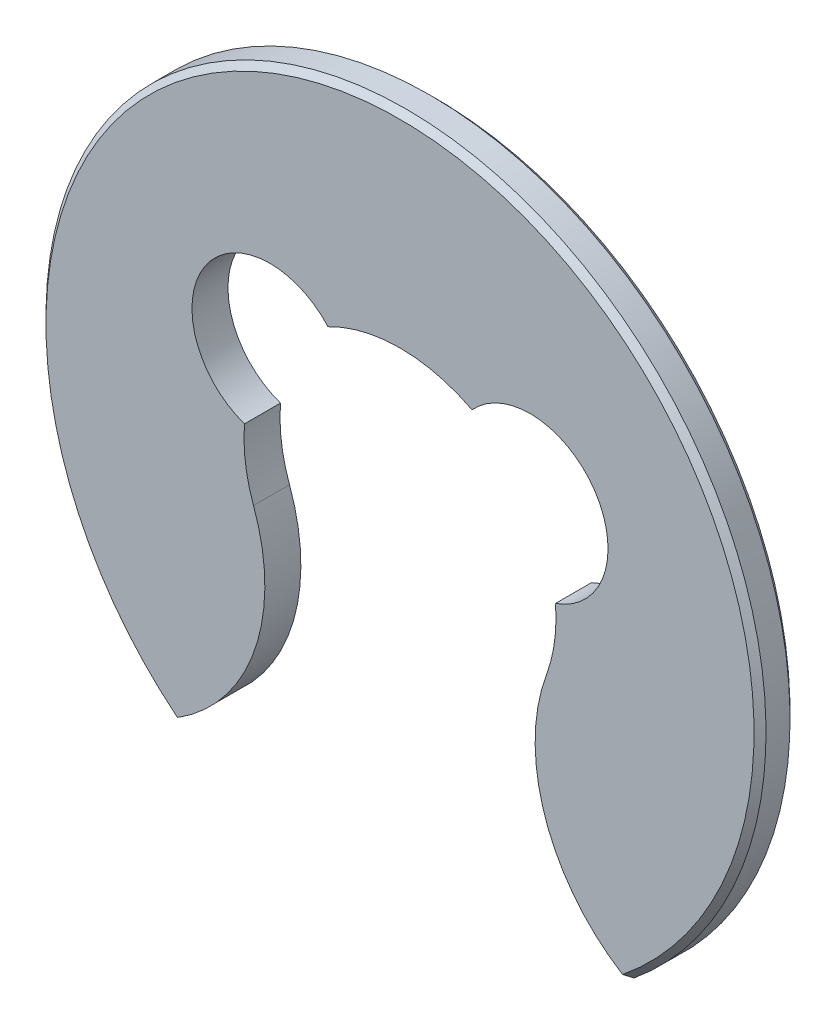
ISO-10303-21;
HEADER;
FILE_DESCRIPTION(('STEP AP214'),'2;1');
FILE_NAME('part.step','',(''),(''),'','','');
FILE_SCHEMA(('AUTOMOTIVE_DESIGN { 1 0 10303 214 1 1 1 1 }'));
ENDSEC;
DATA;
#1=APPLICATION_CONTEXT('core data for automotive mechanical design processes');
#2=APPLICATION_PROTOCOL_DEFINITION('international standard','automotive_design',2000,#1);
#3=PRODUCT_CONTEXT('',#1,'mechanical');
#4=PRODUCT('Part','Part','',(#3));
#5=PRODUCT_RELATED_PRODUCT_CATEGORY('part','',(#4));
#6=PRODUCT_DEFINITION_FORMATION('','',#4);
#7=PRODUCT_DEFINITION_CONTEXT('part definition',#1,'design');
#8=PRODUCT_DEFINITION('design','',#6,#7);
#9=PRODUCT_DEFINITION_SHAPE('','',#8);
#10=(LENGTH_UNIT() NAMED_UNIT(*) SI_UNIT(.MILLI.,.METRE.));
#11=(NAMED_UNIT(*) PLANE_ANGLE_UNIT() SI_UNIT($,.RADIAN.));
#12=(NAMED_UNIT(*) SI_UNIT($,.STERADIAN.) SOLID_ANGLE_UNIT());
#13=UNCERTAINTY_MEASURE_WITH_UNIT(LENGTH_MEASURE(1.E-05),#10,'distance_accuracy_value','');
#14=(GEOMETRIC_REPRESENTATION_CONTEXT(3) GLOBAL_UNCERTAINTY_ASSIGNED_CONTEXT((#13)) GLOBAL_UNIT_ASSIGNED_CONTEXT((#10,
#11,#12)) REPRESENTATION_CONTEXT('',''));
#15=CARTESIAN_POINT('',(0.,0.,0.));
#16=DIRECTION('',(0.,0.,1.));
#17=DIRECTION('',(1.,0.,0.));
#18=AXIS2_PLACEMENT_3D('',#15,#16,#17);
#19=CARTESIAN_POINT('',(0.,0.,0.3));
#20=DIRECTION('',(0.,0.,-1.));
#21=DIRECTION('',(-1.,0.,0.));
#22=AXIS2_PLACEMENT_3D('',#19,#20,#21);
#23=CYLINDRICAL_SURFACE('',#22,1.3);
#24=CARTESIAN_POINT('',(0.,0.,0.));
#25=DIRECTION('',(0.,0.,-1.));
#26=DIRECTION('',(1.,0.,0.));
#27=AXIS2_PLACEMENT_3D('',#24,#25,#26);
#28=CIRCLE('',#27,1.3);
#29=CARTESIAN_POINT('',(-0.600024950994486,1.15324327797047,0.));
#30=VERTEX_POINT('',#29);
#31=CARTESIAN_POINT('',(0.600024950994486,1.15324327797047,0.));
#32=VERTEX_POINT('',#31);
#33=EDGE_CURVE('E138',#30,#32,#28,.T.);
#34=ORIENTED_EDGE('',*,*,#33,.T.);
#35=DIRECTION('',(0.,0.,-1.));
#36=VECTOR('',#35,1.);
#37=CARTESIAN_POINT('',(0.600024950994486,1.15324327797047,0.3));
#38=LINE('',#37,#36);
#39=CARTESIAN_POINT('',(0.600024950994486,1.15324327797047,0.3));
#40=VERTEX_POINT('',#39);
#41=EDGE_CURVE('E118',#40,#32,#38,.T.);
#42=ORIENTED_EDGE('',*,*,#41,.F.);
#43=CARTESIAN_POINT('',(0.,0.,0.3));
#44=DIRECTION('',(0.,0.,-1.));
#45=DIRECTION('',(1.,0.,0.));
#46=AXIS2_PLACEMENT_3D('',#43,#44,#45);
#47=CIRCLE('',#46,1.3);
#48=CARTESIAN_POINT('',(-0.600024950994486,1.15324327797047,0.3));
#49=VERTEX_POINT('',#48);
#50=EDGE_CURVE('E125',#49,#40,#47,.T.);
#51=ORIENTED_EDGE('',*,*,#50,.F.);
#52=DIRECTION('',(0.,0.,-1.));
#53=VECTOR('',#52,1.);
#54=CARTESIAN_POINT('',(-0.600024950994486,1.15324327797047,0.3));
#55=LINE('',#54,#53);
#56=EDGE_CURVE('E219',#49,#30,#55,.T.);
#57=ORIENTED_EDGE('',*,*,#56,.T.);
#58=EDGE_LOOP('',(#34,#42,#51,#57));
#59=FACE_BOUND('',#58,.T.);
#60=ADVANCED_FACE('F35',(#59),#23,.F.);
#61=CARTESIAN_POINT('',(1.08333333333333,0.718602037910337,0.3));
#62=DIRECTION('',(0.,0.,-1.));
#63=DIRECTION('',(-1.,0.,0.));
#64=AXIS2_PLACEMENT_3D('',#61,#62,#63);
#65=CYLINDRICAL_SURFACE('',#64,0.65);
#66=CARTESIAN_POINT('',(1.08333333333333,0.718602037910337,0.));
#67=DIRECTION('',(0.,0.,-1.));
#68=DIRECTION('',(1.,0.,0.));
#69=AXIS2_PLACEMENT_3D('',#66,#67,#68);
#70=CIRCLE('',#69,0.65);
#71=CARTESIAN_POINT('',(1.29580838233885,0.104310288372624,0.));
#72=VERTEX_POINT('',#71);
#73=EDGE_CURVE('E207',#32,#72,#70,.T.);
#74=ORIENTED_EDGE('',*,*,#73,.T.);
#75=DIRECTION('',(0.,0.,-1.));
#76=VECTOR('',#75,1.);
#77=CARTESIAN_POINT('',(1.29580838233885,0.104310288372624,0.3));
#78=LINE('',#77,#76);
#79=CARTESIAN_POINT('',(1.29580838233885,0.104310288372624,0.3));
#80=VERTEX_POINT('',#79);
#81=EDGE_CURVE('E121',#80,#72,#78,.T.);
#82=ORIENTED_EDGE('',*,*,#81,.F.);
#83=CARTESIAN_POINT('',(1.08333333333333,0.718602037910337,0.3));
#84=DIRECTION('',(0.,0.,-1.));
#85=DIRECTION('',(1.,0.,0.));
#86=AXIS2_PLACEMENT_3D('',#83,#84,#85);
#87=CIRCLE('',#86,0.65);
#88=EDGE_CURVE('E114',#40,#80,#87,.T.);
#89=ORIENTED_EDGE('',*,*,#88,.F.);
#90=ORIENTED_EDGE('',*,*,#41,.T.);
#91=EDGE_LOOP('',(#74,#82,#89,#90));
#92=FACE_BOUND('',#91,.T.);
#93=ADVANCED_FACE('F116',(#92),#65,.F.);
#94=CARTESIAN_POINT('',(0.,0.,0.3));
#95=DIRECTION('',(0.,0.,-1.));
#96=DIRECTION('',(-1.,0.,0.));
#97=AXIS2_PLACEMENT_3D('',#94,#95,#96);
#98=CYLINDRICAL_SURFACE('',#97,1.3);
#99=CARTESIAN_POINT('',(0.,0.,0.));
#100=DIRECTION('',(0.,0.,-1.));
#101=DIRECTION('',(1.,0.,0.));
#102=AXIS2_PLACEMENT_3D('',#99,#100,#101);
#103=CIRCLE('',#102,1.3);
#104=CARTESIAN_POINT('',(1.22062990792163,-0.447283610125882,0.));
#105=VERTEX_POINT('',#104);
#106=EDGE_CURVE('E203',#72,#105,#103,.T.);
#107=ORIENTED_EDGE('',*,*,#106,.T.);
#108=DIRECTION('',(0.,0.,-1.));
#109=VECTOR('',#108,1.);
#110=CARTESIAN_POINT('',(1.22062990792163,-0.447283610125882,0.3));
#111=LINE('',#110,#109);
#112=CARTESIAN_POINT('',(1.22062990792163,-0.447283610125882,0.3));
#113=VERTEX_POINT('',#112);
#114=EDGE_CURVE('E144',#113,#105,#111,.T.);
#115=ORIENTED_EDGE('',*,*,#114,.F.);
#116=CARTESIAN_POINT('',(0.,0.,0.3));
#117=DIRECTION('',(0.,0.,-1.));
#118=DIRECTION('',(1.,0.,0.));
#119=AXIS2_PLACEMENT_3D('',#116,#117,#118);
#120=CIRCLE('',#119,1.3);
#121=EDGE_CURVE('E124',#80,#113,#120,.T.);
#122=ORIENTED_EDGE('',*,*,#121,.F.);
#123=ORIENTED_EDGE('',*,*,#81,.T.);
#124=EDGE_LOOP('',(#107,#115,#122,#123));
#125=FACE_BOUND('',#124,.T.);
#126=ADVANCED_FACE('F175',(#125),#98,.F.);
#127=CARTESIAN_POINT('',(2.67529962068804,-0.980327996835039,0.3));
#128=DIRECTION('',(0.,0.,-1.));
#129=DIRECTION('',(-1.,0.,0.));
#130=AXIS2_PLACEMENT_3D('',#127,#128,#129);
#131=CYLINDRICAL_SURFACE('',#130,1.54925798091927);
#132=DIRECTION('',(0.,0.,-1.));
#133=VECTOR('',#132,1.);
#134=CARTESIAN_POINT('',(1.9,-2.32163735324878,0.3));
#135=LINE('',#134,#133);
#136=CARTESIAN_POINT('',(1.9,-2.32163735324878,0.250000000000001));
#137=VERTEX_POINT('',#136);
#138=CARTESIAN_POINT('',(1.9,-2.32163735324878,0.0499999999999997));
#139=VERTEX_POINT('',#138);
#140=EDGE_CURVE('E210',#137,#139,#135,.T.);
#141=ORIENTED_EDGE('',*,*,#140,.F.);
#142=CARTESIAN_POINT('',(1.9,-2.32163735324878,0.250000000000001));
#143=CARTESIAN_POINT('',(1.89230942070195,-2.31719163384908,0.258310767771597));
#144=CARTESIAN_POINT('',(1.88466710213089,-2.31268622857085,0.266632818336292));
#145=CARTESIAN_POINT('',(1.86947898648718,-2.30355604628408,0.28329948500309));
#146=CARTESIAN_POINT('',(1.86193318941397,-2.29893126927624,0.291644101105062));
#147=CARTESIAN_POINT('',(1.85443565306718,-2.29424680639057,0.3));
#148=B_SPLINE_CURVE_WITH_KNOTS('',3,(#142,#143,#144,#145,#146,#147),.UNSPECIFIED.,.F.,.F.,(4,2,
4),(0.,0.0364916719153332,0.0729833436170323),.UNSPECIFIED.);
#149=CARTESIAN_POINT('',(1.85443565306718,-2.29424680639056,0.3));
#150=VERTEX_POINT('',#149);
#151=EDGE_CURVE('E44',#137,#150,#148,.T.);
#152=ORIENTED_EDGE('',*,*,#151,.T.);
#153=CARTESIAN_POINT('',(2.67529962068804,-0.980327996835039,0.3));
#154=DIRECTION('',(0.,0.,1.));
#155=DIRECTION('',(1.,0.,0.));
#156=AXIS2_PLACEMENT_3D('',#153,#154,#155);
#157=CIRCLE('',#156,1.54925798091927);
#158=EDGE_CURVE('E209',#113,#150,#157,.T.);
#159=ORIENTED_EDGE('',*,*,#158,.F.);
#160=ORIENTED_EDGE('',*,*,#114,.T.);
#161=CARTESIAN_POINT('',(2.67529962068804,-0.980327996835039,0.));
#162=DIRECTION('',(0.,0.,1.));
#163=DIRECTION('',(1.,0.,0.));
#164=AXIS2_PLACEMENT_3D('',#161,#162,#163);
#165=CIRCLE('',#164,1.54925798091927);
#166=CARTESIAN_POINT('',(1.85443565306718,-2.29424680639056,0.));
#167=VERTEX_POINT('',#166);
#168=EDGE_CURVE('E206',#105,#167,#165,.T.);
#169=ORIENTED_EDGE('',*,*,#168,.T.);
#170=CARTESIAN_POINT('',(1.85443565306718,-2.29424680639056,0.));
#171=CARTESIAN_POINT('',(1.86193318941397,-2.29893126927624,0.00835589889493776));
#172=CARTESIAN_POINT('',(1.86947898648718,-2.30355604628408,0.0167005149969098));
#173=CARTESIAN_POINT('',(1.88466710213089,-2.31268622857085,0.0333671816637086));
#174=CARTESIAN_POINT('',(1.89230942070195,-2.31719163384908,0.0416892322284032));
#175=CARTESIAN_POINT('',(1.9,-2.32163735324878,0.0499999999999999));
#176=B_SPLINE_CURVE_WITH_KNOTS('',3,(#170,#171,#172,#173,#174,#175),.UNSPECIFIED.,.F.,.F.,(4,2,
4),(0.,0.0364916717016999,0.0729833436170341),.UNSPECIFIED.);
#177=EDGE_CURVE('E56',#167,#139,#176,.T.);
#178=ORIENTED_EDGE('',*,*,#177,.T.);
#179=EDGE_LOOP('',(#141,#152,#159,#160,#169,#178));
#180=FACE_BOUND('',#179,.T.);
#181=ADVANCED_FACE('F170',(#180),#131,.T.);
#182=CARTESIAN_POINT('',(0.,0.,0.3));
#183=DIRECTION('',(0.,0.,-1.));
#184=DIRECTION('',(-1.,0.,0.));
#185=AXIS2_PLACEMENT_3D('',#182,#183,#184);
#186=CYLINDRICAL_SURFACE('',#185,3.);
#187=DIRECTION('',(0.,0.,-1.));
#188=VECTOR('',#187,1.);
#189=CARTESIAN_POINT('',(-1.9,-2.32163735324878,0.3));
#190=LINE('',#189,#188);
#191=CARTESIAN_POINT('',(-1.9,-2.32163735324878,0.250000000000001));
#192=VERTEX_POINT('',#191);
#193=CARTESIAN_POINT('',(-1.9,-2.32163735324878,0.0499999999999994));
#194=VERTEX_POINT('',#193);
#195=EDGE_CURVE('E227',#192,#194,#190,.T.);
#196=ORIENTED_EDGE('',*,*,#195,.F.);
#197=CARTESIAN_POINT('',(0.,0.,0.250000000000001));
#198=DIRECTION('',(0.,0.,1.));
#199=DIRECTION('',(1.,0.,0.));
#200=AXIS2_PLACEMENT_3D('',#197,#198,#199);
#201=CIRCLE('',#200,3.);
#202=EDGE_CURVE('E235',#192,#137,#201,.F.);
#203=ORIENTED_EDGE('',*,*,#202,.T.);
#204=ORIENTED_EDGE('',*,*,#140,.T.);
#205=CARTESIAN_POINT('',(0.,0.,0.0499999999999997));
#206=DIRECTION('',(0.,0.,1.));
#207=DIRECTION('',(1.,0.,0.));
#208=AXIS2_PLACEMENT_3D('',#205,#206,#207);
#209=CIRCLE('',#208,3.);
#210=EDGE_CURVE('E233',#139,#194,#209,.T.);
#211=ORIENTED_EDGE('',*,*,#210,.T.);
#212=EDGE_LOOP('',(#196,#203,#204,#211));
#213=FACE_BOUND('',#212,.T.);
#214=ADVANCED_FACE('F164',(#213),#186,.T.);
#215=CARTESIAN_POINT('',(-2.67529962068804,-0.98032799683504,0.3));
#216=DIRECTION('',(0.,0.,-1.));
#217=DIRECTION('',(-1.,0.,0.));
#218=AXIS2_PLACEMENT_3D('',#215,#216,#217);
#219=CYLINDRICAL_SURFACE('',#218,1.54925798091927);
#220=CARTESIAN_POINT('',(-2.67529962068804,-0.98032799683504,0.3));
#221=DIRECTION('',(0.,0.,1.));
#222=DIRECTION('',(-1.,0.,0.));
#223=AXIS2_PLACEMENT_3D('',#220,#221,#222);
#224=CIRCLE('',#223,1.54925798091927);
#225=CARTESIAN_POINT('',(-1.85443565306718,-2.29424680639057,0.3));
#226=VERTEX_POINT('',#225);
#227=CARTESIAN_POINT('',(-1.22062990792163,-0.447283610125881,0.3));
#228=VERTEX_POINT('',#227);
#229=EDGE_CURVE('E240',#226,#228,#224,.T.);
#230=ORIENTED_EDGE('',*,*,#229,.F.);
#231=CARTESIAN_POINT('',(-1.85443565306718,-2.29424680639057,0.3));
#232=CARTESIAN_POINT('',(-1.86193318941397,-2.29893126927624,0.291644101105062));
#233=CARTESIAN_POINT('',(-1.86947898648718,-2.30355604628408,0.28329948500309));
#234=CARTESIAN_POINT('',(-1.88466710213089,-2.31268622857086,0.266632818336292));
#235=CARTESIAN_POINT('',(-1.89230942070195,-2.31719163384908,0.258310767771597));
#236=CARTESIAN_POINT('',(-1.9,-2.32163735324878,0.25));
#237=B_SPLINE_CURVE_WITH_KNOTS('',3,(#231,#232,#233,#234,#235,#236),.UNSPECIFIED.,.F.,.F.,(4,2,
4),(0.,0.0364916717016991,0.0729833436170321),.UNSPECIFIED.);
#238=EDGE_CURVE('E153',#226,#192,#237,.T.);
#239=ORIENTED_EDGE('',*,*,#238,.T.);
#240=ORIENTED_EDGE('',*,*,#195,.T.);
#241=CARTESIAN_POINT('',(-1.9,-2.32163735324878,0.0499999999999997));
#242=CARTESIAN_POINT('',(-1.89230942070195,-2.31719163384908,0.0416892322284031));
#243=CARTESIAN_POINT('',(-1.88466710213089,-2.31268622857085,0.0333671816637086));
#244=CARTESIAN_POINT('',(-1.86947898648718,-2.30355604628408,0.01670051499691));
#245=CARTESIAN_POINT('',(-1.86193318941397,-2.29893126927624,0.00835589889493804));
#246=CARTESIAN_POINT('',(-1.85443565306718,-2.29424680639057,0.));
#247=B_SPLINE_CURVE_WITH_KNOTS('',3,(#241,#242,#243,#244,#245,#246),.UNSPECIFIED.,.F.,.F.,(4,2,
4),(0.,0.0364916719153342,0.072983343617034),.UNSPECIFIED.);
#248=CARTESIAN_POINT('',(-1.85443565306718,-2.29424680639056,0.));
#249=VERTEX_POINT('',#248);
#250=EDGE_CURVE('E142',#194,#249,#247,.T.);
#251=ORIENTED_EDGE('',*,*,#250,.T.);
#252=CARTESIAN_POINT('',(-2.67529962068804,-0.98032799683504,0.));
#253=DIRECTION('',(0.,0.,1.));
#254=DIRECTION('',(-1.,0.,0.));
#255=AXIS2_PLACEMENT_3D('',#252,#253,#254);
#256=CIRCLE('',#255,1.54925798091927);
#257=CARTESIAN_POINT('',(-1.22062990792163,-0.447283610125881,0.));
#258=VERTEX_POINT('',#257);
#259=EDGE_CURVE('E211',#249,#258,#256,.T.);
#260=ORIENTED_EDGE('',*,*,#259,.T.);
#261=DIRECTION('',(0.,0.,-1.));
#262=VECTOR('',#261,1.);
#263=CARTESIAN_POINT('',(-1.22062990792163,-0.447283610125881,0.3));
#264=LINE('',#263,#262);
#265=EDGE_CURVE('E224',#228,#258,#264,.T.);
#266=ORIENTED_EDGE('',*,*,#265,.F.);
#267=EDGE_LOOP('',(#230,#239,#240,#251,#260,#266));
#268=FACE_BOUND('',#267,.T.);
#269=ADVANCED_FACE('F158',(#268),#219,.T.);
#270=CARTESIAN_POINT('',(0.,0.,0.3));
#271=DIRECTION('',(0.,0.,-1.));
#272=DIRECTION('',(-1.,0.,0.));
#273=AXIS2_PLACEMENT_3D('',#270,#271,#272);
#274=CYLINDRICAL_SURFACE('',#273,1.3);
#275=CARTESIAN_POINT('',(0.,0.,0.));
#276=DIRECTION('',(0.,0.,-1.));
#277=DIRECTION('',(1.,0.,0.));
#278=AXIS2_PLACEMENT_3D('',#275,#276,#277);
#279=CIRCLE('',#278,1.3);
#280=CARTESIAN_POINT('',(-1.29580838233885,0.104310288372624,0.));
#281=VERTEX_POINT('',#280);
#282=EDGE_CURVE('E213',#258,#281,#279,.T.);
#283=ORIENTED_EDGE('',*,*,#282,.T.);
#284=DIRECTION('',(0.,0.,-1.));
#285=VECTOR('',#284,1.);
#286=CARTESIAN_POINT('',(-1.29580838233885,0.104310288372624,0.3));
#287=LINE('',#286,#285);
#288=CARTESIAN_POINT('',(-1.29580838233885,0.104310288372624,0.3));
#289=VERTEX_POINT('',#288);
#290=EDGE_CURVE('E221',#289,#281,#287,.T.);
#291=ORIENTED_EDGE('',*,*,#290,.F.);
#292=CARTESIAN_POINT('',(0.,0.,0.3));
#293=DIRECTION('',(0.,0.,-1.));
#294=DIRECTION('',(1.,0.,0.));
#295=AXIS2_PLACEMENT_3D('',#292,#293,#294);
#296=CIRCLE('',#295,1.3);
#297=EDGE_CURVE('E243',#228,#289,#296,.T.);
#298=ORIENTED_EDGE('',*,*,#297,.F.);
#299=ORIENTED_EDGE('',*,*,#265,.T.);
#300=EDGE_LOOP('',(#283,#291,#298,#299));
#301=FACE_BOUND('',#300,.T.);
#302=ADVANCED_FACE('F163',(#301),#274,.F.);
#303=CARTESIAN_POINT('',(-1.08333333333333,0.718602037910337,0.3));
#304=DIRECTION('',(0.,0.,-1.));
#305=DIRECTION('',(-1.,0.,0.));
#306=AXIS2_PLACEMENT_3D('',#303,#304,#305);
#307=CYLINDRICAL_SURFACE('',#306,0.65);
#308=CARTESIAN_POINT('',(-1.08333333333333,0.718602037910337,0.));
#309=DIRECTION('',(0.,0.,-1.));
#310=DIRECTION('',(1.,0.,0.));
#311=AXIS2_PLACEMENT_3D('',#308,#309,#310);
#312=CIRCLE('',#311,0.65);
#313=EDGE_CURVE('E135',#281,#30,#312,.T.);
#314=ORIENTED_EDGE('',*,*,#313,.T.);
#315=ORIENTED_EDGE('',*,*,#56,.F.);
#316=CARTESIAN_POINT('',(-1.08333333333333,0.718602037910337,0.3));
#317=DIRECTION('',(0.,0.,-1.));
#318=DIRECTION('',(1.,0.,0.));
#319=AXIS2_PLACEMENT_3D('',#316,#317,#318);
#320=CIRCLE('',#319,0.65);
#321=EDGE_CURVE('E131',#289,#49,#320,.T.);
#322=ORIENTED_EDGE('',*,*,#321,.F.);
#323=ORIENTED_EDGE('',*,*,#290,.T.);
#324=EDGE_LOOP('',(#314,#315,#322,#323));
#325=FACE_BOUND('',#324,.T.);
#326=ADVANCED_FACE('F252',(#325),#307,.F.);
#327=CARTESIAN_POINT('',(-0.541666666666667,0.359301018955168,0.3));
#328=DIRECTION('',(0.,0.,1.));
#329=DIRECTION('',(1.,0.,0.));
#330=AXIS2_PLACEMENT_3D('',#327,#328,#329);
#331=PLANE('',#330);
#332=ORIENTED_EDGE('',*,*,#158,.T.);
#333=CARTESIAN_POINT('',(0.,0.,0.3));
#334=DIRECTION('',(0.,0.,1.));
#335=DIRECTION('',(1.,0.,0.));
#336=AXIS2_PLACEMENT_3D('',#333,#334,#335);
#337=CIRCLE('',#336,2.95);
#338=EDGE_CURVE('E139',#150,#226,#337,.T.);
#339=ORIENTED_EDGE('',*,*,#338,.T.);
#340=ORIENTED_EDGE('',*,*,#229,.T.);
#341=ORIENTED_EDGE('',*,*,#297,.T.);
#342=ORIENTED_EDGE('',*,*,#321,.T.);
#343=ORIENTED_EDGE('',*,*,#50,.T.);
#344=ORIENTED_EDGE('',*,*,#88,.T.);
#345=ORIENTED_EDGE('',*,*,#121,.T.);
#346=EDGE_LOOP('',(#332,#339,#340,#341,#342,#343,#344,#345));
#347=FACE_BOUND('',#346,.T.);
#348=ADVANCED_FACE('F129',(#347),#331,.T.);
#349=CARTESIAN_POINT('',(-0.541666666666667,0.359301018955168,0.));
#350=DIRECTION('',(0.,0.,1.));
#351=DIRECTION('',(1.,0.,0.));
#352=AXIS2_PLACEMENT_3D('',#349,#350,#351);
#353=PLANE('',#352);
#354=ORIENTED_EDGE('',*,*,#259,.F.);
#355=CARTESIAN_POINT('',(0.,0.,0.));
#356=DIRECTION('',(0.,0.,1.));
#357=DIRECTION('',(1.,0.,0.));
#358=AXIS2_PLACEMENT_3D('',#355,#356,#357);
#359=CIRCLE('',#358,2.95);
#360=EDGE_CURVE('E11',#249,#167,#359,.F.);
#361=ORIENTED_EDGE('',*,*,#360,.T.);
#362=ORIENTED_EDGE('',*,*,#168,.F.);
#363=ORIENTED_EDGE('',*,*,#106,.F.);
#364=ORIENTED_EDGE('',*,*,#73,.F.);
#365=ORIENTED_EDGE('',*,*,#33,.F.);
#366=ORIENTED_EDGE('',*,*,#313,.F.);
#367=ORIENTED_EDGE('',*,*,#282,.F.);
#368=EDGE_LOOP('',(#354,#361,#362,#363,#364,#365,#366,#367));
#369=FACE_BOUND('',#368,.T.);
#370=ADVANCED_FACE('F190',(#369),#353,.F.);
#371=CARTESIAN_POINT('',(0.,0.,0.3));
#372=DIRECTION('',(0.,0.,-1.));
#373=DIRECTION('',(-1.,0.,0.));
#374=AXIS2_PLACEMENT_3D('',#371,#372,#373);
#375=CONICAL_SURFACE('',#374,2.95,0.785398163397427);
#376=ORIENTED_EDGE('',*,*,#151,.F.);
#377=ORIENTED_EDGE('',*,*,#202,.F.);
#378=ORIENTED_EDGE('',*,*,#238,.F.);
#379=ORIENTED_EDGE('',*,*,#338,.F.);
#380=EDGE_LOOP('',(#376,#377,#378,#379));
#381=FACE_BOUND('',#380,.T.);
#382=ADVANCED_FACE('F186',(#381),#375,.T.);
#383=CARTESIAN_POINT('',(0.,0.,0.0499999999999997));
#384=DIRECTION('',(0.,0.,1.));
#385=DIRECTION('',(1.,0.,0.));
#386=AXIS2_PLACEMENT_3D('',#383,#384,#385);
#387=CONICAL_SURFACE('',#386,3.,0.785398163397444);
#388=ORIENTED_EDGE('',*,*,#177,.F.);
#389=ORIENTED_EDGE('',*,*,#360,.F.);
#390=ORIENTED_EDGE('',*,*,#250,.F.);
#391=ORIENTED_EDGE('',*,*,#210,.F.);
#392=EDGE_LOOP('',(#388,#389,#390,#391));
#393=FACE_BOUND('',#392,.T.);
#394=ADVANCED_FACE('F37',(#393),#387,.T.);
#395=CLOSED_SHELL('',(#60,#93,#126,#181,#214,#269,#302,#326,#348,#370,#382,#394));
#396=MANIFOLD_SOLID_BREP('B2',#395);
#397=ADVANCED_BREP_SHAPE_REPRESENTATION('',(#18,#396),#14);
#398=SHAPE_DEFINITION_REPRESENTATION(#9,#397);
ENDSEC;
END-ISO-10303-21;
